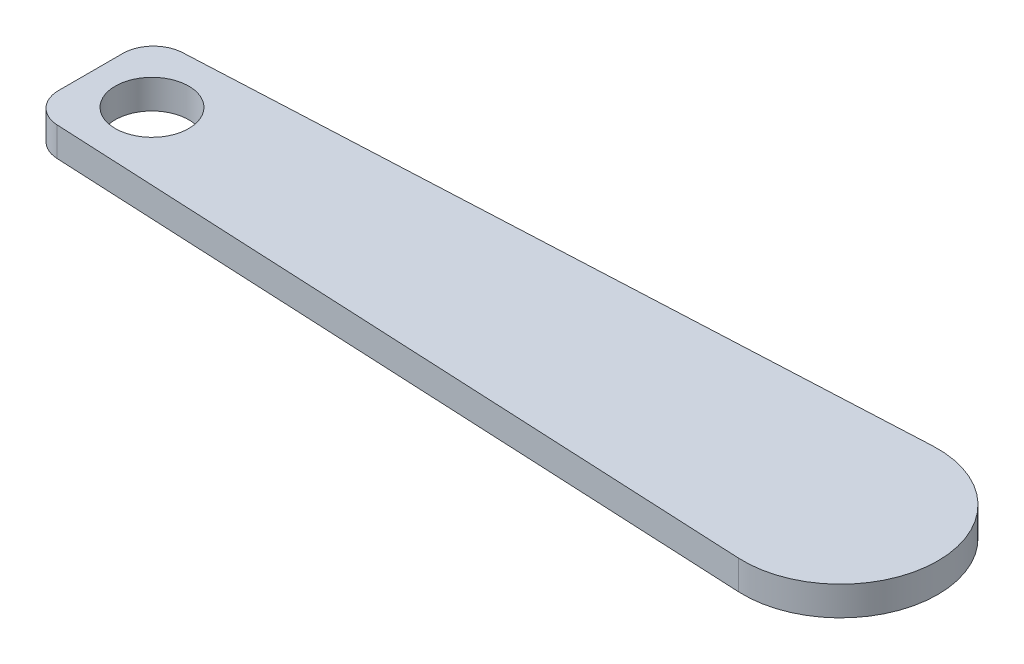
ISO-10303-21;
HEADER;
FILE_DESCRIPTION(('STEP AP214'),'2;1');
FILE_NAME('part.step','',(''),(''),'','','');
FILE_SCHEMA(('AUTOMOTIVE_DESIGN { 1 0 10303 214 1 1 1 1 }'));
ENDSEC;
DATA;
#1=APPLICATION_CONTEXT('core data for automotive mechanical design processes');
#2=APPLICATION_PROTOCOL_DEFINITION('international standard','automotive_design',2000,#1);
#3=PRODUCT_CONTEXT('',#1,'mechanical');
#4=PRODUCT('Part','Part','',(#3));
#5=PRODUCT_RELATED_PRODUCT_CATEGORY('part','',(#4));
#6=PRODUCT_DEFINITION_FORMATION('','',#4);
#7=PRODUCT_DEFINITION_CONTEXT('part definition',#1,'design');
#8=PRODUCT_DEFINITION('design','',#6,#7);
#9=PRODUCT_DEFINITION_SHAPE('','',#8);
#10=(LENGTH_UNIT() NAMED_UNIT(*) SI_UNIT(.MILLI.,.METRE.));
#11=(NAMED_UNIT(*) PLANE_ANGLE_UNIT() SI_UNIT($,.RADIAN.));
#12=(NAMED_UNIT(*) SI_UNIT($,.STERADIAN.) SOLID_ANGLE_UNIT());
#13=UNCERTAINTY_MEASURE_WITH_UNIT(LENGTH_MEASURE(1.E-05),#10,'distance_accuracy_value','');
#14=(GEOMETRIC_REPRESENTATION_CONTEXT(3) GLOBAL_UNCERTAINTY_ASSIGNED_CONTEXT((#13)) GLOBAL_UNIT_ASSIGNED_CONTEXT((#10,
#11,#12)) REPRESENTATION_CONTEXT('',''));
#15=CARTESIAN_POINT('',(0.,0.,0.));
#16=DIRECTION('',(0.,0.,1.));
#17=DIRECTION('',(1.,0.,0.));
#18=AXIS2_PLACEMENT_3D('',#15,#16,#17);
#19=CARTESIAN_POINT('',(-0.763550448226396,4.7625,15.8566268705867));
#20=DIRECTION('',(0.0480976660300092,0.,-0.998842637517275));
#21=DIRECTION('',(-0.998842637517275,0.,-0.0480976660300092));
#22=AXIS2_PLACEMENT_3D('',#19,#20,#21);
#23=PLANE('',#22);
#24=DIRECTION('',(0.998842637517275,0.,0.0480976660300092));
#25=VECTOR('',#24,1.);
#26=CARTESIAN_POINT('',(-0.763550448226396,4.7625,15.8566268705867));
#27=LINE('',#26,#25);
#28=CARTESIAN_POINT('',(-117.6284150365,4.7625,10.2291866547982));
#29=VERTEX_POINT('',#28);
#30=CARTESIAN_POINT('',(-0.763550448226396,4.7625,15.8566268705867));
#31=VERTEX_POINT('',#30);
#32=EDGE_CURVE('E102',#29,#31,#27,.T.);
#33=ORIENTED_EDGE('',*,*,#32,.F.);
#34=DIRECTION('',(0.,-1.,0.));
#35=VECTOR('',#34,1.);
#36=CARTESIAN_POINT('',(-117.6284150365,0.,10.2291866547982));
#37=LINE('',#36,#35);
#38=CARTESIAN_POINT('',(-117.6284150365,0.,10.2291866547982));
#39=VERTEX_POINT('',#38);
#40=EDGE_CURVE('E12',#29,#39,#37,.T.);
#41=ORIENTED_EDGE('',*,*,#40,.T.);
#42=DIRECTION('',(0.998842637517275,0.,0.0480976660300092));
#43=VECTOR('',#42,1.);
#44=CARTESIAN_POINT('',(-0.763550448226396,0.,15.8566268705867));
#45=LINE('',#44,#43);
#46=CARTESIAN_POINT('',(-0.763550448226396,0.,15.8566268705867));
#47=VERTEX_POINT('',#46);
#48=EDGE_CURVE('E124',#39,#47,#45,.T.);
#49=ORIENTED_EDGE('',*,*,#48,.T.);
#50=DIRECTION('',(0.,-1.,0.));
#51=VECTOR('',#50,1.);
#52=CARTESIAN_POINT('',(-0.763550448226396,4.7625,15.8566268705867));
#53=LINE('',#52,#51);
#54=EDGE_CURVE('E117',#31,#47,#53,.T.);
#55=ORIENTED_EDGE('',*,*,#54,.F.);
#56=EDGE_LOOP('',(#33,#41,#49,#55));
#57=FACE_BOUND('',#56,.T.);
#58=ADVANCED_FACE('F48',(#57),#23,.F.);
#59=CARTESIAN_POINT('',(0.,4.7625,0.));
#60=DIRECTION('',(0.,-1.,0.));
#61=DIRECTION('',(0.,0.,-1.));
#62=AXIS2_PLACEMENT_3D('',#59,#60,#61);
#63=CYLINDRICAL_SURFACE('',#62,15.875);
#64=CARTESIAN_POINT('',(0.,0.,0.));
#65=DIRECTION('',(0.,1.,0.));
#66=DIRECTION('',(0.,0.,1.));
#67=AXIS2_PLACEMENT_3D('',#64,#65,#66);
#68=CIRCLE('',#67,15.875);
#69=CARTESIAN_POINT('',(-0.763550448226396,0.,-15.8566268705867));
#70=VERTEX_POINT('',#69);
#71=EDGE_CURVE('E172',#47,#70,#68,.T.);
#72=ORIENTED_EDGE('',*,*,#71,.T.);
#73=DIRECTION('',(0.,-1.,0.));
#74=VECTOR('',#73,1.);
#75=CARTESIAN_POINT('',(-0.763550448226396,4.7625,-15.8566268705867));
#76=LINE('',#75,#74);
#77=CARTESIAN_POINT('',(-0.763550448226396,4.7625,-15.8566268705867));
#78=VERTEX_POINT('',#77);
#79=EDGE_CURVE('E119',#78,#70,#76,.T.);
#80=ORIENTED_EDGE('',*,*,#79,.F.);
#81=CARTESIAN_POINT('',(0.,4.7625,0.));
#82=DIRECTION('',(0.,1.,0.));
#83=DIRECTION('',(0.,0.,1.));
#84=AXIS2_PLACEMENT_3D('',#81,#82,#83);
#85=CIRCLE('',#84,15.875);
#86=EDGE_CURVE('E106',#31,#78,#85,.T.);
#87=ORIENTED_EDGE('',*,*,#86,.F.);
#88=ORIENTED_EDGE('',*,*,#54,.T.);
#89=EDGE_LOOP('',(#72,#80,#87,#88));
#90=FACE_BOUND('',#89,.T.);
#91=ADVANCED_FACE('F116',(#90),#63,.T.);
#92=CARTESIAN_POINT('',(-0.763550448226396,4.7625,-15.8566268705867));
#93=DIRECTION('',(0.0480976660300092,0.,0.998842637517275));
#94=DIRECTION('',(0.998842637517275,0.,-0.0480976660300092));
#95=AXIS2_PLACEMENT_3D('',#92,#93,#94);
#96=PLANE('',#95);
#97=DIRECTION('',(-0.998842637517275,0.,0.0480976660300092));
#98=VECTOR('',#97,1.);
#99=CARTESIAN_POINT('',(-0.763550448226396,0.,-15.8566268705867));
#100=LINE('',#99,#98);
#101=CARTESIAN_POINT('',(-117.6284150365,0.,-10.2291866547982));
#102=VERTEX_POINT('',#101);
#103=EDGE_CURVE('E175',#70,#102,#100,.T.);
#104=ORIENTED_EDGE('',*,*,#103,.T.);
#105=DIRECTION('',(0.,-1.,0.));
#106=VECTOR('',#105,1.);
#107=CARTESIAN_POINT('',(-117.6284150365,4.7625,-10.2291866547982));
#108=LINE('',#107,#106);
#109=CARTESIAN_POINT('',(-117.6284150365,4.7625,-10.2291866547982));
#110=VERTEX_POINT('',#109);
#111=EDGE_CURVE('E72',#102,#110,#108,.F.);
#112=ORIENTED_EDGE('',*,*,#111,.T.);
#113=DIRECTION('',(-0.998842637517275,0.,0.0480976660300092));
#114=VECTOR('',#113,1.);
#115=CARTESIAN_POINT('',(-0.763550448226396,4.7625,-15.8566268705867));
#116=LINE('',#115,#114);
#117=EDGE_CURVE('E121',#78,#110,#116,.T.);
#118=ORIENTED_EDGE('',*,*,#117,.F.);
#119=ORIENTED_EDGE('',*,*,#79,.T.);
#120=EDGE_LOOP('',(#104,#112,#118,#119));
#121=FACE_BOUND('',#120,.T.);
#122=ADVANCED_FACE('F197',(#121),#96,.F.);
#123=CARTESIAN_POINT('',(-122.38792670635,4.7625,0.));
#124=DIRECTION('',(-1.,0.,0.));
#125=DIRECTION('',(0.,0.,1.));
#126=AXIS2_PLACEMENT_3D('',#123,#124,#125);
#127=PLANE('',#126);
#128=DIRECTION('',(0.,0.,-1.));
#129=VECTOR('',#128,1.);
#130=CARTESIAN_POINT('',(-122.38792670635,4.7625,0.));
#131=LINE('',#130,#129);
#132=CARTESIAN_POINT('',(-122.38792670635,4.7625,5.2349734672118));
#133=VERTEX_POINT('',#132);
#134=CARTESIAN_POINT('',(-122.38792670635,4.7625,-5.23497346721181));
#135=VERTEX_POINT('',#134);
#136=EDGE_CURVE('E161',#133,#135,#131,.T.);
#137=ORIENTED_EDGE('',*,*,#136,.T.);
#138=DIRECTION('',(0.,-1.,0.));
#139=VECTOR('',#138,1.);
#140=CARTESIAN_POINT('',(-122.38792670635,0.,-5.23497346721181));
#141=LINE('',#140,#139);
#142=CARTESIAN_POINT('',(-122.38792670635,0.,-5.23497346721181));
#143=VERTEX_POINT('',#142);
#144=EDGE_CURVE('E131',#135,#143,#141,.T.);
#145=ORIENTED_EDGE('',*,*,#144,.T.);
#146=DIRECTION('',(0.,0.,-1.));
#147=VECTOR('',#146,1.);
#148=CARTESIAN_POINT('',(-122.38792670635,0.,0.));
#149=LINE('',#148,#147);
#150=CARTESIAN_POINT('',(-122.38792670635,0.,5.2349734672118));
#151=VERTEX_POINT('',#150);
#152=EDGE_CURVE('E178',#151,#143,#149,.T.);
#153=ORIENTED_EDGE('',*,*,#152,.F.);
#154=DIRECTION('',(0.,-1.,0.));
#155=VECTOR('',#154,1.);
#156=CARTESIAN_POINT('',(-122.38792670635,4.7625,5.2349734672118));
#157=LINE('',#156,#155);
#158=EDGE_CURVE('E127',#151,#133,#157,.F.);
#159=ORIENTED_EDGE('',*,*,#158,.T.);
#160=EDGE_LOOP('',(#137,#145,#153,#159));
#161=FACE_BOUND('',#160,.T.);
#162=ADVANCED_FACE('F189',(#161),#127,.T.);
#163=CARTESIAN_POINT('',(-112.38792670635,4.7625,0.));
#164=DIRECTION('',(0.,-1.,0.));
#165=DIRECTION('',(0.,0.,-1.));
#166=AXIS2_PLACEMENT_3D('',#163,#164,#165);
#167=CYLINDRICAL_SURFACE('',#166,6.00000000000002);
#168=CARTESIAN_POINT('',(-112.38792670635,4.7625,0.));
#169=DIRECTION('',(0.,1.,0.));
#170=DIRECTION('',(0.,0.,1.));
#171=AXIS2_PLACEMENT_3D('',#168,#169,#170);
#172=CIRCLE('',#171,6.00000000000002);
#173=CARTESIAN_POINT('',(-112.38792670635,4.7625,6.00000000000002));
#174=VERTEX_POINT('',#173);
#175=EDGE_CURVE('E133',#174,#174,#172,.T.);
#176=ORIENTED_EDGE('',*,*,#175,.T.);
#177=EDGE_LOOP('',(#176));
#178=FACE_BOUND('',#177,.T.);
#179=CARTESIAN_POINT('',(-112.38792670635,0.,0.));
#180=DIRECTION('',(0.,1.,0.));
#181=DIRECTION('',(0.,0.,1.));
#182=AXIS2_PLACEMENT_3D('',#179,#180,#181);
#183=CIRCLE('',#182,6.00000000000002);
#184=CARTESIAN_POINT('',(-112.38792670635,0.,6.00000000000002));
#185=VERTEX_POINT('',#184);
#186=EDGE_CURVE('E112',#185,#185,#183,.T.);
#187=ORIENTED_EDGE('',*,*,#186,.F.);
#188=EDGE_LOOP('',(#187));
#189=FACE_BOUND('',#188,.T.);
#190=ADVANCED_FACE('F187',(#178,#189),#167,.F.);
#191=CARTESIAN_POINT('',(0.,4.7625,0.));
#192=DIRECTION('',(0.,1.,0.));
#193=DIRECTION('',(0.,0.,1.));
#194=AXIS2_PLACEMENT_3D('',#191,#192,#193);
#195=PLANE('',#194);
#196=ORIENTED_EDGE('',*,*,#117,.T.);
#197=CARTESIAN_POINT('',(-117.38792670635,4.7625,-5.23497346721181));
#198=DIRECTION('',(0.,1.,0.));
#199=DIRECTION('',(0.,0.,1.));
#200=AXIS2_PLACEMENT_3D('',#197,#198,#199);
#201=CIRCLE('',#200,5.);
#202=EDGE_CURVE('E57',#110,#135,#201,.T.);
#203=ORIENTED_EDGE('',*,*,#202,.T.);
#204=ORIENTED_EDGE('',*,*,#136,.F.);
#205=CARTESIAN_POINT('',(-117.38792670635,4.7625,5.2349734672118));
#206=DIRECTION('',(0.,1.,0.));
#207=DIRECTION('',(0.,0.,1.));
#208=AXIS2_PLACEMENT_3D('',#205,#206,#207);
#209=CIRCLE('',#208,5.);
#210=EDGE_CURVE('E64',#133,#29,#209,.T.);
#211=ORIENTED_EDGE('',*,*,#210,.T.);
#212=ORIENTED_EDGE('',*,*,#32,.T.);
#213=ORIENTED_EDGE('',*,*,#86,.T.);
#214=EDGE_LOOP('',(#196,#203,#204,#211,#212,#213));
#215=FACE_BOUND('',#214,.T.);
#216=ORIENTED_EDGE('',*,*,#175,.F.);
#217=EDGE_LOOP('',(#216));
#218=FACE_BOUND('',#217,.T.);
#219=ADVANCED_FACE('F104',(#215,#218),#195,.T.);
#220=CARTESIAN_POINT('',(0.,0.,0.));
#221=DIRECTION('',(0.,1.,0.));
#222=DIRECTION('',(0.,0.,1.));
#223=AXIS2_PLACEMENT_3D('',#220,#221,#222);
#224=PLANE('',#223);
#225=ORIENTED_EDGE('',*,*,#152,.T.);
#226=CARTESIAN_POINT('',(-117.38792670635,0.,-5.23497346721181));
#227=DIRECTION('',(0.,1.,0.));
#228=DIRECTION('',(0.,0.,1.));
#229=AXIS2_PLACEMENT_3D('',#226,#227,#228);
#230=CIRCLE('',#229,5.);
#231=EDGE_CURVE('E143',#143,#102,#230,.F.);
#232=ORIENTED_EDGE('',*,*,#231,.T.);
#233=ORIENTED_EDGE('',*,*,#103,.F.);
#234=ORIENTED_EDGE('',*,*,#71,.F.);
#235=ORIENTED_EDGE('',*,*,#48,.F.);
#236=CARTESIAN_POINT('',(-117.38792670635,0.,5.2349734672118));
#237=DIRECTION('',(0.,1.,0.));
#238=DIRECTION('',(0.,0.,1.));
#239=AXIS2_PLACEMENT_3D('',#236,#237,#238);
#240=CIRCLE('',#239,5.);
#241=EDGE_CURVE('E140',#39,#151,#240,.F.);
#242=ORIENTED_EDGE('',*,*,#241,.T.);
#243=EDGE_LOOP('',(#225,#232,#233,#234,#235,#242));
#244=FACE_BOUND('',#243,.T.);
#245=ORIENTED_EDGE('',*,*,#186,.T.);
#246=EDGE_LOOP('',(#245));
#247=FACE_BOUND('',#246,.T.);
#248=ADVANCED_FACE('F185',(#244,#247),#224,.F.);
#249=CARTESIAN_POINT('',(-117.38792670635,4.7625,-5.23497346721181));
#250=DIRECTION('',(0.,1.,0.));
#251=DIRECTION('',(0.,0.,1.));
#252=AXIS2_PLACEMENT_3D('',#249,#250,#251);
#253=CYLINDRICAL_SURFACE('',#252,5.);
#254=ORIENTED_EDGE('',*,*,#202,.F.);
#255=ORIENTED_EDGE('',*,*,#111,.F.);
#256=ORIENTED_EDGE('',*,*,#231,.F.);
#257=ORIENTED_EDGE('',*,*,#144,.F.);
#258=EDGE_LOOP('',(#254,#255,#256,#257));
#259=FACE_BOUND('',#258,.T.);
#260=ADVANCED_FACE('F208',(#259),#253,.T.);
#261=CARTESIAN_POINT('',(-117.38792670635,4.7625,5.2349734672118));
#262=DIRECTION('',(0.,1.,0.));
#263=DIRECTION('',(0.,0.,1.));
#264=AXIS2_PLACEMENT_3D('',#261,#262,#263);
#265=CYLINDRICAL_SURFACE('',#264,5.);
#266=ORIENTED_EDGE('',*,*,#210,.F.);
#267=ORIENTED_EDGE('',*,*,#158,.F.);
#268=ORIENTED_EDGE('',*,*,#241,.F.);
#269=ORIENTED_EDGE('',*,*,#40,.F.);
#270=EDGE_LOOP('',(#266,#267,#268,#269));
#271=FACE_BOUND('',#270,.T.);
#272=ADVANCED_FACE('F50',(#271),#265,.T.);
#273=CLOSED_SHELL('',(#58,#91,#122,#162,#190,#219,#248,#260,#272));
#274=MANIFOLD_SOLID_BREP('B2',#273);
#275=ADVANCED_BREP_SHAPE_REPRESENTATION('',(#18,#274),#14);
#276=SHAPE_DEFINITION_REPRESENTATION(#9,#275);
ENDSEC;
END-ISO-10303-21;
